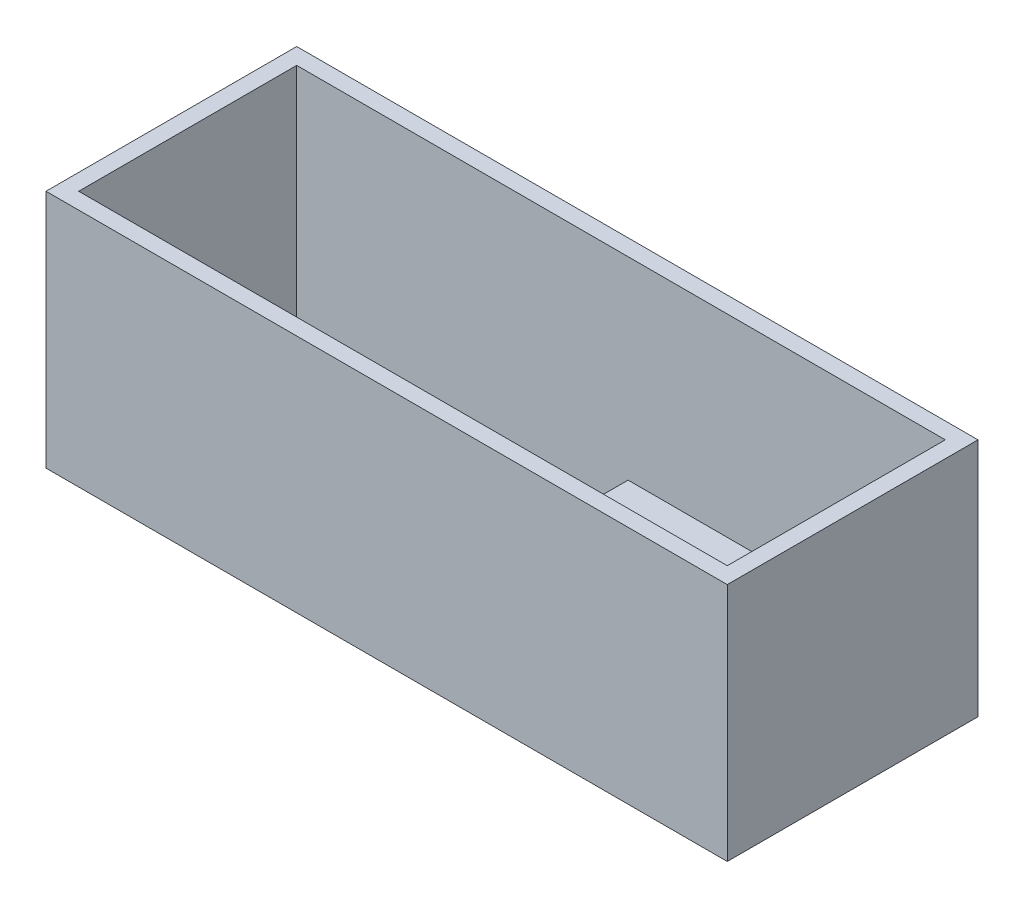
ISO-10303-21;
HEADER;
FILE_DESCRIPTION(('STEP AP214'),'2;1');
FILE_NAME('part.step','',(''),(''),'','','');
FILE_SCHEMA(('AUTOMOTIVE_DESIGN { 1 0 10303 214 1 1 1 1 }'));
ENDSEC;
DATA;
#1=APPLICATION_CONTEXT('core data for automotive mechanical design processes');
#2=APPLICATION_PROTOCOL_DEFINITION('international standard','automotive_design',2000,#1);
#3=PRODUCT_CONTEXT('',#1,'mechanical');
#4=PRODUCT('Part','Part','',(#3));
#5=PRODUCT_RELATED_PRODUCT_CATEGORY('part','',(#4));
#6=PRODUCT_DEFINITION_FORMATION('','',#4);
#7=PRODUCT_DEFINITION_CONTEXT('part definition',#1,'design');
#8=PRODUCT_DEFINITION('design','',#6,#7);
#9=PRODUCT_DEFINITION_SHAPE('','',#8);
#10=(LENGTH_UNIT() NAMED_UNIT(*) SI_UNIT(.MILLI.,.METRE.));
#11=(NAMED_UNIT(*) PLANE_ANGLE_UNIT() SI_UNIT($,.RADIAN.));
#12=(NAMED_UNIT(*) SI_UNIT($,.STERADIAN.) SOLID_ANGLE_UNIT());
#13=UNCERTAINTY_MEASURE_WITH_UNIT(LENGTH_MEASURE(1.E-05),#10,'distance_accuracy_value','');
#14=(GEOMETRIC_REPRESENTATION_CONTEXT(3) GLOBAL_UNCERTAINTY_ASSIGNED_CONTEXT((#13)) GLOBAL_UNIT_ASSIGNED_CONTEXT((#10,
#11,#12)) REPRESENTATION_CONTEXT('',''));
#15=CARTESIAN_POINT('',(0.,0.,0.));
#16=DIRECTION('',(0.,0.,1.));
#17=DIRECTION('',(1.,0.,0.));
#18=AXIS2_PLACEMENT_3D('',#15,#16,#17);
#19=CARTESIAN_POINT('',(59.5,44.,20.));
#20=DIRECTION('',(0.,0.,-1.));
#21=DIRECTION('',(-1.,0.,0.));
#22=AXIS2_PLACEMENT_3D('',#19,#20,#21);
#23=PLANE('',#22);
#24=DIRECTION('',(1.,0.,0.));
#25=VECTOR('',#24,1.);
#26=CARTESIAN_POINT('',(1.29999999999998,8.5,20.));
#27=LINE('',#26,#25);
#28=CARTESIAN_POINT('',(1.29999999999998,8.5,20.));
#29=VERTEX_POINT('',#28);
#30=CARTESIAN_POINT('',(29.3,8.5,20.));
#31=VERTEX_POINT('',#30);
#32=EDGE_CURVE('E160',#29,#31,#27,.T.);
#33=ORIENTED_EDGE('',*,*,#32,.F.);
#34=DIRECTION('',(0.,-1.,0.));
#35=VECTOR('',#34,1.);
#36=CARTESIAN_POINT('',(1.29999999999998,7.,20.));
#37=LINE('',#36,#35);
#38=CARTESIAN_POINT('',(1.29999999999998,4.,20.));
#39=VERTEX_POINT('',#38);
#40=EDGE_CURVE('E63',#29,#39,#37,.T.);
#41=ORIENTED_EDGE('',*,*,#40,.T.);
#42=DIRECTION('',(1.,0.,0.));
#43=VECTOR('',#42,1.);
#44=CARTESIAN_POINT('',(-59.5,4.,20.));
#45=LINE('',#44,#43);
#46=CARTESIAN_POINT('',(-59.5,4.,20.));
#47=VERTEX_POINT('',#46);
#48=EDGE_CURVE('E11',#47,#39,#45,.T.);
#49=ORIENTED_EDGE('',*,*,#48,.F.);
#50=DIRECTION('',(0.,-1.,0.));
#51=VECTOR('',#50,1.);
#52=CARTESIAN_POINT('',(-59.5,44.,20.));
#53=LINE('',#52,#51);
#54=CARTESIAN_POINT('',(-59.5,44.,20.));
#55=VERTEX_POINT('',#54);
#56=EDGE_CURVE('E206',#55,#47,#53,.T.);
#57=ORIENTED_EDGE('',*,*,#56,.F.);
#58=DIRECTION('',(1.,0.,0.));
#59=VECTOR('',#58,1.);
#60=CARTESIAN_POINT('',(59.5,44.,20.));
#61=LINE('',#60,#59);
#62=CARTESIAN_POINT('',(59.5,44.,20.));
#63=VERTEX_POINT('',#62);
#64=EDGE_CURVE('E185',#55,#63,#61,.T.);
#65=ORIENTED_EDGE('',*,*,#64,.T.);
#66=DIRECTION('',(0.,-1.,0.));
#67=VECTOR('',#66,1.);
#68=CARTESIAN_POINT('',(59.5,44.,20.));
#69=LINE('',#68,#67);
#70=CARTESIAN_POINT('',(59.5,7.,20.));
#71=VERTEX_POINT('',#70);
#72=EDGE_CURVE('E202',#63,#71,#69,.T.);
#73=ORIENTED_EDGE('',*,*,#72,.T.);
#74=DIRECTION('',(1.,0.,0.));
#75=VECTOR('',#74,1.);
#76=CARTESIAN_POINT('',(1.29999999999998,7.,20.));
#77=LINE('',#76,#75);
#78=CARTESIAN_POINT('',(29.3,7.,20.));
#79=VERTEX_POINT('',#78);
#80=EDGE_CURVE('E171',#79,#71,#77,.T.);
#81=ORIENTED_EDGE('',*,*,#80,.F.);
#82=DIRECTION('',(0.,-1.,0.));
#83=VECTOR('',#82,1.);
#84=CARTESIAN_POINT('',(29.3,8.5,20.));
#85=LINE('',#84,#83);
#86=EDGE_CURVE('E55',#31,#79,#85,.T.);
#87=ORIENTED_EDGE('',*,*,#86,.F.);
#88=EDGE_LOOP('',(#33,#41,#49,#57,#65,#73,#81,#87));
#89=FACE_BOUND('',#88,.T.);
#90=ADVANCED_FACE('F39',(#89),#23,.T.);
#91=CARTESIAN_POINT('',(59.5,44.,-20.));
#92=DIRECTION('',(0.,0.,1.));
#93=DIRECTION('',(1.,0.,0.));
#94=AXIS2_PLACEMENT_3D('',#91,#92,#93);
#95=PLANE('',#94);
#96=DIRECTION('',(0.,-1.,0.));
#97=VECTOR('',#96,1.);
#98=CARTESIAN_POINT('',(1.29999999999998,7.,-20.));
#99=LINE('',#98,#97);
#100=CARTESIAN_POINT('',(1.29999999999998,8.5,-20.));
#101=VERTEX_POINT('',#100);
#102=CARTESIAN_POINT('',(1.29999999999998,4.,-20.));
#103=VERTEX_POINT('',#102);
#104=EDGE_CURVE('E140',#101,#103,#99,.T.);
#105=ORIENTED_EDGE('',*,*,#104,.F.);
#106=DIRECTION('',(-1.,0.,0.));
#107=VECTOR('',#106,1.);
#108=CARTESIAN_POINT('',(1.29999999999998,8.5,-20.));
#109=LINE('',#108,#107);
#110=CARTESIAN_POINT('',(29.3,8.5,-20.));
#111=VERTEX_POINT('',#110);
#112=EDGE_CURVE('E146',#111,#101,#109,.T.);
#113=ORIENTED_EDGE('',*,*,#112,.F.);
#114=DIRECTION('',(0.,-1.,0.));
#115=VECTOR('',#114,1.);
#116=CARTESIAN_POINT('',(29.3,8.5,-20.));
#117=LINE('',#116,#115);
#118=CARTESIAN_POINT('',(29.3,7.,-20.));
#119=VERTEX_POINT('',#118);
#120=EDGE_CURVE('E143',#111,#119,#117,.T.);
#121=ORIENTED_EDGE('',*,*,#120,.T.);
#122=DIRECTION('',(-1.,0.,0.));
#123=VECTOR('',#122,1.);
#124=CARTESIAN_POINT('',(1.29999999999998,7.,-20.));
#125=LINE('',#124,#123);
#126=CARTESIAN_POINT('',(59.5,7.,-20.));
#127=VERTEX_POINT('',#126);
#128=EDGE_CURVE('E130',#127,#119,#125,.T.);
#129=ORIENTED_EDGE('',*,*,#128,.F.);
#130=DIRECTION('',(0.,-1.,0.));
#131=VECTOR('',#130,1.);
#132=CARTESIAN_POINT('',(59.5,44.,-20.));
#133=LINE('',#132,#131);
#134=CARTESIAN_POINT('',(59.5,44.,-20.));
#135=VERTEX_POINT('',#134);
#136=EDGE_CURVE('E199',#135,#127,#133,.T.);
#137=ORIENTED_EDGE('',*,*,#136,.F.);
#138=DIRECTION('',(-1.,0.,0.));
#139=VECTOR('',#138,1.);
#140=CARTESIAN_POINT('',(59.5,44.,-20.));
#141=LINE('',#140,#139);
#142=CARTESIAN_POINT('',(-59.5,44.,-20.));
#143=VERTEX_POINT('',#142);
#144=EDGE_CURVE('E192',#135,#143,#141,.T.);
#145=ORIENTED_EDGE('',*,*,#144,.T.);
#146=DIRECTION('',(0.,-1.,0.));
#147=VECTOR('',#146,1.);
#148=CARTESIAN_POINT('',(-59.5,44.,-20.));
#149=LINE('',#148,#147);
#150=CARTESIAN_POINT('',(-59.5,4.,-20.));
#151=VERTEX_POINT('',#150);
#152=EDGE_CURVE('E195',#143,#151,#149,.T.);
#153=ORIENTED_EDGE('',*,*,#152,.T.);
#154=DIRECTION('',(-1.,0.,0.));
#155=VECTOR('',#154,1.);
#156=CARTESIAN_POINT('',(-59.5,4.,-20.));
#157=LINE('',#156,#155);
#158=EDGE_CURVE('E252',#103,#151,#157,.T.);
#159=ORIENTED_EDGE('',*,*,#158,.F.);
#160=EDGE_LOOP('',(#105,#113,#121,#129,#137,#145,#153,#159));
#161=FACE_BOUND('',#160,.T.);
#162=ADVANCED_FACE('F144',(#161),#95,.T.);
#163=CARTESIAN_POINT('',(0.,7.,0.));
#164=DIRECTION('',(0.,-1.,0.));
#165=DIRECTION('',(0.,0.,-1.));
#166=AXIS2_PLACEMENT_3D('',#163,#164,#165);
#167=PLANE('',#166);
#168=DIRECTION('',(0.,0.,-1.));
#169=VECTOR('',#168,1.);
#170=CARTESIAN_POINT('',(29.3,7.,-20.));
#171=LINE('',#170,#169);
#172=EDGE_CURVE('E134',#79,#119,#171,.T.);
#173=ORIENTED_EDGE('',*,*,#172,.F.);
#174=ORIENTED_EDGE('',*,*,#80,.T.);
#175=DIRECTION('',(0.,0.,-1.));
#176=VECTOR('',#175,1.);
#177=CARTESIAN_POINT('',(59.5,7.,20.));
#178=LINE('',#177,#176);
#179=EDGE_CURVE('E136',#71,#127,#178,.T.);
#180=ORIENTED_EDGE('',*,*,#179,.T.);
#181=ORIENTED_EDGE('',*,*,#128,.T.);
#182=EDGE_LOOP('',(#173,#174,#180,#181));
#183=FACE_BOUND('',#182,.T.);
#184=ADVANCED_FACE('F132',(#183),#167,.F.);
#185=CARTESIAN_POINT('',(0.,4.,0.));
#186=DIRECTION('',(0.,-1.,0.));
#187=DIRECTION('',(0.,0.,-1.));
#188=AXIS2_PLACEMENT_3D('',#185,#186,#187);
#189=PLANE('',#188);
#190=DIRECTION('',(0.,0.,1.));
#191=VECTOR('',#190,1.);
#192=CARTESIAN_POINT('',(1.29999999999998,4.,20.));
#193=LINE('',#192,#191);
#194=EDGE_CURVE('E170',#103,#39,#193,.T.);
#195=ORIENTED_EDGE('',*,*,#194,.F.);
#196=ORIENTED_EDGE('',*,*,#158,.T.);
#197=DIRECTION('',(0.,0.,1.));
#198=VECTOR('',#197,1.);
#199=CARTESIAN_POINT('',(-59.5,4.,20.));
#200=LINE('',#199,#198);
#201=EDGE_CURVE('E48',#151,#47,#200,.T.);
#202=ORIENTED_EDGE('',*,*,#201,.T.);
#203=ORIENTED_EDGE('',*,*,#48,.T.);
#204=EDGE_LOOP('',(#195,#196,#202,#203));
#205=FACE_BOUND('',#204,.T.);
#206=ADVANCED_FACE('F259',(#205),#189,.F.);
#207=CARTESIAN_POINT('',(59.5,44.,20.));
#208=DIRECTION('',(-1.,0.,0.));
#209=DIRECTION('',(0.,0.,1.));
#210=AXIS2_PLACEMENT_3D('',#207,#208,#209);
#211=PLANE('',#210);
#212=ORIENTED_EDGE('',*,*,#136,.T.);
#213=ORIENTED_EDGE('',*,*,#179,.F.);
#214=ORIENTED_EDGE('',*,*,#72,.F.);
#215=DIRECTION('',(0.,0.,-1.));
#216=VECTOR('',#215,1.);
#217=CARTESIAN_POINT('',(59.5,44.,20.));
#218=LINE('',#217,#216);
#219=EDGE_CURVE('E188',#63,#135,#218,.T.);
#220=ORIENTED_EDGE('',*,*,#219,.T.);
#221=EDGE_LOOP('',(#212,#213,#214,#220));
#222=FACE_BOUND('',#221,.T.);
#223=ADVANCED_FACE('F273',(#222),#211,.T.);
#224=CARTESIAN_POINT('',(-59.5,44.,20.));
#225=DIRECTION('',(1.,0.,0.));
#226=DIRECTION('',(0.,0.,-1.));
#227=AXIS2_PLACEMENT_3D('',#224,#225,#226);
#228=PLANE('',#227);
#229=ORIENTED_EDGE('',*,*,#201,.F.);
#230=ORIENTED_EDGE('',*,*,#152,.F.);
#231=DIRECTION('',(0.,0.,1.));
#232=VECTOR('',#231,1.);
#233=CARTESIAN_POINT('',(-59.5,44.,20.));
#234=LINE('',#233,#232);
#235=EDGE_CURVE('E182',#143,#55,#234,.T.);
#236=ORIENTED_EDGE('',*,*,#235,.T.);
#237=ORIENTED_EDGE('',*,*,#56,.T.);
#238=EDGE_LOOP('',(#229,#230,#236,#237));
#239=FACE_BOUND('',#238,.T.);
#240=ADVANCED_FACE('F263',(#239),#228,.T.);
#241=CARTESIAN_POINT('',(0.,44.,0.));
#242=DIRECTION('',(0.,-1.,0.));
#243=DIRECTION('',(0.,0.,-1.));
#244=AXIS2_PLACEMENT_3D('',#241,#242,#243);
#245=PLANE('',#244);
#246=DIRECTION('',(0.,0.,-1.));
#247=VECTOR('',#246,1.);
#248=CARTESIAN_POINT('',(62.5,44.,23.));
#249=LINE('',#248,#247);
#250=CARTESIAN_POINT('',(62.5,44.,23.));
#251=VERTEX_POINT('',#250);
#252=CARTESIAN_POINT('',(62.5,44.,-23.));
#253=VERTEX_POINT('',#252);
#254=EDGE_CURVE('E211',#251,#253,#249,.T.);
#255=ORIENTED_EDGE('',*,*,#254,.T.);
#256=DIRECTION('',(-1.,0.,0.));
#257=VECTOR('',#256,1.);
#258=CARTESIAN_POINT('',(-62.5,44.,-23.));
#259=LINE('',#258,#257);
#260=CARTESIAN_POINT('',(-62.5,44.,-23.));
#261=VERTEX_POINT('',#260);
#262=EDGE_CURVE('E215',#253,#261,#259,.T.);
#263=ORIENTED_EDGE('',*,*,#262,.T.);
#264=DIRECTION('',(0.,0.,1.));
#265=VECTOR('',#264,1.);
#266=CARTESIAN_POINT('',(-62.5,44.,23.));
#267=LINE('',#266,#265);
#268=CARTESIAN_POINT('',(-62.5,44.,23.));
#269=VERTEX_POINT('',#268);
#270=EDGE_CURVE('E219',#261,#269,#267,.T.);
#271=ORIENTED_EDGE('',*,*,#270,.T.);
#272=DIRECTION('',(1.,0.,0.));
#273=VECTOR('',#272,1.);
#274=CARTESIAN_POINT('',(-62.5,44.,23.));
#275=LINE('',#274,#273);
#276=EDGE_CURVE('E222',#269,#251,#275,.T.);
#277=ORIENTED_EDGE('',*,*,#276,.T.);
#278=EDGE_LOOP('',(#255,#263,#271,#277));
#279=FACE_BOUND('',#278,.T.);
#280=ORIENTED_EDGE('',*,*,#235,.F.);
#281=ORIENTED_EDGE('',*,*,#144,.F.);
#282=ORIENTED_EDGE('',*,*,#219,.F.);
#283=ORIENTED_EDGE('',*,*,#64,.F.);
#284=EDGE_LOOP('',(#280,#281,#282,#283));
#285=FACE_BOUND('',#284,.T.);
#286=ADVANCED_FACE('F270',(#279,#285),#245,.F.);
#287=CARTESIAN_POINT('',(62.5,44.,23.));
#288=DIRECTION('',(-1.,0.,0.));
#289=DIRECTION('',(0.,0.,1.));
#290=AXIS2_PLACEMENT_3D('',#287,#288,#289);
#291=PLANE('',#290);
#292=DIRECTION('',(0.,0.,-1.));
#293=VECTOR('',#292,1.);
#294=CARTESIAN_POINT('',(62.5,0.,23.));
#295=LINE('',#294,#293);
#296=CARTESIAN_POINT('',(62.5,0.,23.));
#297=VERTEX_POINT('',#296);
#298=CARTESIAN_POINT('',(62.5,0.,-23.));
#299=VERTEX_POINT('',#298);
#300=EDGE_CURVE('E210',#297,#299,#295,.T.);
#301=ORIENTED_EDGE('',*,*,#300,.T.);
#302=DIRECTION('',(0.,-1.,0.));
#303=VECTOR('',#302,1.);
#304=CARTESIAN_POINT('',(62.5,44.,-23.));
#305=LINE('',#304,#303);
#306=EDGE_CURVE('E248',#253,#299,#305,.T.);
#307=ORIENTED_EDGE('',*,*,#306,.F.);
#308=ORIENTED_EDGE('',*,*,#254,.F.);
#309=DIRECTION('',(0.,-1.,0.));
#310=VECTOR('',#309,1.);
#311=CARTESIAN_POINT('',(62.5,44.,23.));
#312=LINE('',#311,#310);
#313=EDGE_CURVE('E225',#251,#297,#312,.T.);
#314=ORIENTED_EDGE('',*,*,#313,.T.);
#315=EDGE_LOOP('',(#301,#307,#308,#314));
#316=FACE_BOUND('',#315,.T.);
#317=ADVANCED_FACE('F302',(#316),#291,.F.);
#318=CARTESIAN_POINT('',(-62.5,44.,-23.));
#319=DIRECTION('',(0.,0.,1.));
#320=DIRECTION('',(1.,0.,0.));
#321=AXIS2_PLACEMENT_3D('',#318,#319,#320);
#322=PLANE('',#321);
#323=DIRECTION('',(-1.,0.,0.));
#324=VECTOR('',#323,1.);
#325=CARTESIAN_POINT('',(-62.5,0.,-23.));
#326=LINE('',#325,#324);
#327=CARTESIAN_POINT('',(-62.5,0.,-23.));
#328=VERTEX_POINT('',#327);
#329=EDGE_CURVE('E229',#299,#328,#326,.T.);
#330=ORIENTED_EDGE('',*,*,#329,.T.);
#331=DIRECTION('',(0.,-1.,0.));
#332=VECTOR('',#331,1.);
#333=CARTESIAN_POINT('',(-62.5,44.,-23.));
#334=LINE('',#333,#332);
#335=EDGE_CURVE('E244',#261,#328,#334,.T.);
#336=ORIENTED_EDGE('',*,*,#335,.F.);
#337=ORIENTED_EDGE('',*,*,#262,.F.);
#338=ORIENTED_EDGE('',*,*,#306,.T.);
#339=EDGE_LOOP('',(#330,#336,#337,#338));
#340=FACE_BOUND('',#339,.T.);
#341=ADVANCED_FACE('F310',(#340),#322,.F.);
#342=CARTESIAN_POINT('',(-62.5,44.,23.));
#343=DIRECTION('',(1.,0.,0.));
#344=DIRECTION('',(0.,0.,-1.));
#345=AXIS2_PLACEMENT_3D('',#342,#343,#344);
#346=PLANE('',#345);
#347=DIRECTION('',(0.,0.,1.));
#348=VECTOR('',#347,1.);
#349=CARTESIAN_POINT('',(-62.5,0.,23.));
#350=LINE('',#349,#348);
#351=CARTESIAN_POINT('',(-62.5,0.,23.));
#352=VERTEX_POINT('',#351);
#353=EDGE_CURVE('E232',#328,#352,#350,.T.);
#354=ORIENTED_EDGE('',*,*,#353,.T.);
#355=DIRECTION('',(0.,-1.,0.));
#356=VECTOR('',#355,1.);
#357=CARTESIAN_POINT('',(-62.5,44.,23.));
#358=LINE('',#357,#356);
#359=EDGE_CURVE('E240',#269,#352,#358,.T.);
#360=ORIENTED_EDGE('',*,*,#359,.F.);
#361=ORIENTED_EDGE('',*,*,#270,.F.);
#362=ORIENTED_EDGE('',*,*,#335,.T.);
#363=EDGE_LOOP('',(#354,#360,#361,#362));
#364=FACE_BOUND('',#363,.T.);
#365=ADVANCED_FACE('F306',(#364),#346,.F.);
#366=CARTESIAN_POINT('',(-62.5,44.,23.));
#367=DIRECTION('',(0.,0.,-1.));
#368=DIRECTION('',(-1.,0.,0.));
#369=AXIS2_PLACEMENT_3D('',#366,#367,#368);
#370=PLANE('',#369);
#371=DIRECTION('',(1.,0.,0.));
#372=VECTOR('',#371,1.);
#373=CARTESIAN_POINT('',(-62.5,0.,23.));
#374=LINE('',#373,#372);
#375=EDGE_CURVE('E216',#352,#297,#374,.T.);
#376=ORIENTED_EDGE('',*,*,#375,.T.);
#377=ORIENTED_EDGE('',*,*,#313,.F.);
#378=ORIENTED_EDGE('',*,*,#276,.F.);
#379=ORIENTED_EDGE('',*,*,#359,.T.);
#380=EDGE_LOOP('',(#376,#377,#378,#379));
#381=FACE_BOUND('',#380,.T.);
#382=ADVANCED_FACE('F287',(#381),#370,.F.);
#383=CARTESIAN_POINT('',(0.,0.,0.));
#384=DIRECTION('',(0.,-1.,0.));
#385=DIRECTION('',(0.,0.,-1.));
#386=AXIS2_PLACEMENT_3D('',#383,#384,#385);
#387=PLANE('',#386);
#388=CARTESIAN_POINT('',(39.5,0.,0.));
#389=DIRECTION('',(0.,-1.,0.));
#390=DIRECTION('',(0.,0.,-1.));
#391=AXIS2_PLACEMENT_3D('',#388,#389,#390);
#392=CIRCLE('',#391,11.5);
#393=CARTESIAN_POINT('',(39.5,0.,-11.5));
#394=VERTEX_POINT('',#393);
#395=EDGE_CURVE('E163',#394,#394,#392,.T.);
#396=ORIENTED_EDGE('',*,*,#395,.F.);
#397=EDGE_LOOP('',(#396));
#398=FACE_BOUND('',#397,.T.);
#399=ORIENTED_EDGE('',*,*,#300,.F.);
#400=ORIENTED_EDGE('',*,*,#375,.F.);
#401=ORIENTED_EDGE('',*,*,#353,.F.);
#402=ORIENTED_EDGE('',*,*,#329,.F.);
#403=EDGE_LOOP('',(#399,#400,#401,#402));
#404=FACE_BOUND('',#403,.T.);
#405=ADVANCED_FACE('F41',(#398,#404),#387,.T.);
#406=CARTESIAN_POINT('',(1.29999999999998,7.,20.));
#407=DIRECTION('',(1.,0.,0.));
#408=DIRECTION('',(0.,0.,-1.));
#409=AXIS2_PLACEMENT_3D('',#406,#407,#408);
#410=PLANE('',#409);
#411=ORIENTED_EDGE('',*,*,#194,.T.);
#412=ORIENTED_EDGE('',*,*,#40,.F.);
#413=DIRECTION('',(0.,0.,1.));
#414=VECTOR('',#413,1.);
#415=CARTESIAN_POINT('',(1.29999999999998,8.5,-20.));
#416=LINE('',#415,#414);
#417=EDGE_CURVE('E154',#101,#29,#416,.T.);
#418=ORIENTED_EDGE('',*,*,#417,.F.);
#419=ORIENTED_EDGE('',*,*,#104,.T.);
#420=EDGE_LOOP('',(#411,#412,#418,#419));
#421=FACE_BOUND('',#420,.T.);
#422=ADVANCED_FACE('F278',(#421),#410,.F.);
#423=CARTESIAN_POINT('',(29.3,8.5,-20.));
#424=DIRECTION('',(-1.,0.,0.));
#425=DIRECTION('',(0.,0.,1.));
#426=AXIS2_PLACEMENT_3D('',#423,#424,#425);
#427=PLANE('',#426);
#428=ORIENTED_EDGE('',*,*,#172,.T.);
#429=ORIENTED_EDGE('',*,*,#120,.F.);
#430=DIRECTION('',(0.,0.,-1.));
#431=VECTOR('',#430,1.);
#432=CARTESIAN_POINT('',(29.3,8.5,-20.));
#433=LINE('',#432,#431);
#434=EDGE_CURVE('E276',#31,#111,#433,.T.);
#435=ORIENTED_EDGE('',*,*,#434,.F.);
#436=ORIENTED_EDGE('',*,*,#86,.T.);
#437=EDGE_LOOP('',(#428,#429,#435,#436));
#438=FACE_BOUND('',#437,.T.);
#439=ADVANCED_FACE('F152',(#438),#427,.F.);
#440=CARTESIAN_POINT('',(0.,8.5,0.));
#441=DIRECTION('',(0.,1.,0.));
#442=DIRECTION('',(0.,0.,1.));
#443=AXIS2_PLACEMENT_3D('',#440,#441,#442);
#444=PLANE('',#443);
#445=ORIENTED_EDGE('',*,*,#417,.T.);
#446=ORIENTED_EDGE('',*,*,#32,.T.);
#447=ORIENTED_EDGE('',*,*,#434,.T.);
#448=ORIENTED_EDGE('',*,*,#112,.T.);
#449=EDGE_LOOP('',(#445,#446,#447,#448));
#450=FACE_BOUND('',#449,.T.);
#451=ADVANCED_FACE('F275',(#450),#444,.T.);
#452=CARTESIAN_POINT('',(39.5,3.,0.));
#453=DIRECTION('',(0.,-1.,0.));
#454=DIRECTION('',(0.,0.,-1.));
#455=AXIS2_PLACEMENT_3D('',#452,#453,#454);
#456=CYLINDRICAL_SURFACE('',#455,11.5);
#457=ORIENTED_EDGE('',*,*,#395,.T.);
#458=EDGE_LOOP('',(#457));
#459=FACE_BOUND('',#458,.T.);
#460=CARTESIAN_POINT('',(39.5,4.,0.));
#461=DIRECTION('',(0.,-1.,0.));
#462=DIRECTION('',(0.,0.,-1.));
#463=AXIS2_PLACEMENT_3D('',#460,#461,#462);
#464=CIRCLE('',#463,11.5);
#465=CARTESIAN_POINT('',(39.5,4.,-11.5));
#466=VERTEX_POINT('',#465);
#467=EDGE_CURVE('E363',#466,#466,#464,.T.);
#468=ORIENTED_EDGE('',*,*,#467,.F.);
#469=EDGE_LOOP('',(#468));
#470=FACE_BOUND('',#469,.T.);
#471=ADVANCED_FACE('F327',(#459,#470),#456,.F.);
#472=CARTESIAN_POINT('',(39.5,4.,0.));
#473=DIRECTION('',(0.,-1.,0.));
#474=DIRECTION('',(0.,0.,-1.));
#475=AXIS2_PLACEMENT_3D('',#472,#473,#474);
#476=PLANE('',#475);
#477=CARTESIAN_POINT('',(39.5,4.,0.));
#478=DIRECTION('',(0.,-1.,0.));
#479=DIRECTION('',(0.,0.,-1.));
#480=AXIS2_PLACEMENT_3D('',#477,#478,#479);
#481=CIRCLE('',#480,9.);
#482=CARTESIAN_POINT('',(39.5,4.,-9.));
#483=VERTEX_POINT('',#482);
#484=EDGE_CURVE('E355',#483,#483,#481,.T.);
#485=ORIENTED_EDGE('',*,*,#484,.F.);
#486=EDGE_LOOP('',(#485));
#487=FACE_BOUND('',#486,.T.);
#488=ORIENTED_EDGE('',*,*,#467,.T.);
#489=EDGE_LOOP('',(#488));
#490=FACE_BOUND('',#489,.T.);
#491=ADVANCED_FACE('F340',(#487,#490),#476,.T.);
#492=CARTESIAN_POINT('',(39.5,4.,0.));
#493=DIRECTION('',(0.,-1.,0.));
#494=DIRECTION('',(0.,0.,-1.));
#495=AXIS2_PLACEMENT_3D('',#492,#493,#494);
#496=CYLINDRICAL_SURFACE('',#495,9.);
#497=ORIENTED_EDGE('',*,*,#484,.T.);
#498=EDGE_LOOP('',(#497));
#499=FACE_BOUND('',#498,.T.);
#500=CARTESIAN_POINT('',(39.5,3.,0.));
#501=DIRECTION('',(0.,-1.,0.));
#502=DIRECTION('',(0.,0.,-1.));
#503=AXIS2_PLACEMENT_3D('',#500,#501,#502);
#504=CIRCLE('',#503,9.);
#505=CARTESIAN_POINT('',(39.5,3.,-9.));
#506=VERTEX_POINT('',#505);
#507=EDGE_CURVE('E358',#506,#506,#504,.T.);
#508=ORIENTED_EDGE('',*,*,#507,.F.);
#509=EDGE_LOOP('',(#508));
#510=FACE_BOUND('',#509,.T.);
#511=ADVANCED_FACE('F336',(#499,#510),#496,.T.);
#512=CARTESIAN_POINT('',(39.5,-12.,0.));
#513=DIRECTION('',(0.,-1.,0.));
#514=DIRECTION('',(0.,0.,-1.));
#515=AXIS2_PLACEMENT_3D('',#512,#513,#514);
#516=PLANE('',#515);
#517=CARTESIAN_POINT('',(39.5,-12.,0.));
#518=DIRECTION('',(0.,-1.,0.));
#519=DIRECTION('',(0.,0.,-1.));
#520=AXIS2_PLACEMENT_3D('',#517,#518,#519);
#521=CIRCLE('',#520,4.);
#522=CARTESIAN_POINT('',(39.5,-12.,-4.));
#523=VERTEX_POINT('',#522);
#524=EDGE_CURVE('E155',#523,#523,#521,.T.);
#525=ORIENTED_EDGE('',*,*,#524,.T.);
#526=EDGE_LOOP('',(#525));
#527=FACE_BOUND('',#526,.T.);
#528=ADVANCED_FACE('F332',(#527),#516,.T.);
#529=CARTESIAN_POINT('',(39.5,-12.,0.));
#530=DIRECTION('',(0.,1.,0.));
#531=DIRECTION('',(0.,0.,1.));
#532=AXIS2_PLACEMENT_3D('',#529,#530,#531);
#533=CYLINDRICAL_SURFACE('',#532,4.);
#534=ORIENTED_EDGE('',*,*,#524,.F.);
#535=EDGE_LOOP('',(#534));
#536=FACE_BOUND('',#535,.T.);
#537=CARTESIAN_POINT('',(39.5,3.,0.));
#538=DIRECTION('',(0.,-1.,0.));
#539=DIRECTION('',(0.,0.,-1.));
#540=AXIS2_PLACEMENT_3D('',#537,#538,#539);
#541=CIRCLE('',#540,4.);
#542=CARTESIAN_POINT('',(39.5,3.,-4.));
#543=VERTEX_POINT('',#542);
#544=EDGE_CURVE('E369',#543,#543,#541,.T.);
#545=ORIENTED_EDGE('',*,*,#544,.T.);
#546=EDGE_LOOP('',(#545));
#547=FACE_BOUND('',#546,.T.);
#548=ADVANCED_FACE('F328',(#536,#547),#533,.T.);
#549=CARTESIAN_POINT('',(39.5,3.,0.));
#550=DIRECTION('',(0.,-1.,0.));
#551=DIRECTION('',(0.,0.,-1.));
#552=AXIS2_PLACEMENT_3D('',#549,#550,#551);
#553=PLANE('',#552);
#554=ORIENTED_EDGE('',*,*,#544,.F.);
#555=EDGE_LOOP('',(#554));
#556=FACE_BOUND('',#555,.T.);
#557=ORIENTED_EDGE('',*,*,#507,.T.);
#558=EDGE_LOOP('',(#557));
#559=FACE_BOUND('',#558,.T.);
#560=ADVANCED_FACE('F331',(#556,#559),#553,.T.);
#561=CLOSED_SHELL('',(#90,#162,#184,#206,#223,#240,#286,#317,#341,#365,#382,#405,#422,#439,#451,
#471,#491,#511,#528,#548,#560));
#562=MANIFOLD_SOLID_BREP('B2',#561);
#563=ADVANCED_BREP_SHAPE_REPRESENTATION('',(#18,#562),#14);
#564=SHAPE_DEFINITION_REPRESENTATION(#9,#563);
ENDSEC;
END-ISO-10303-21;
